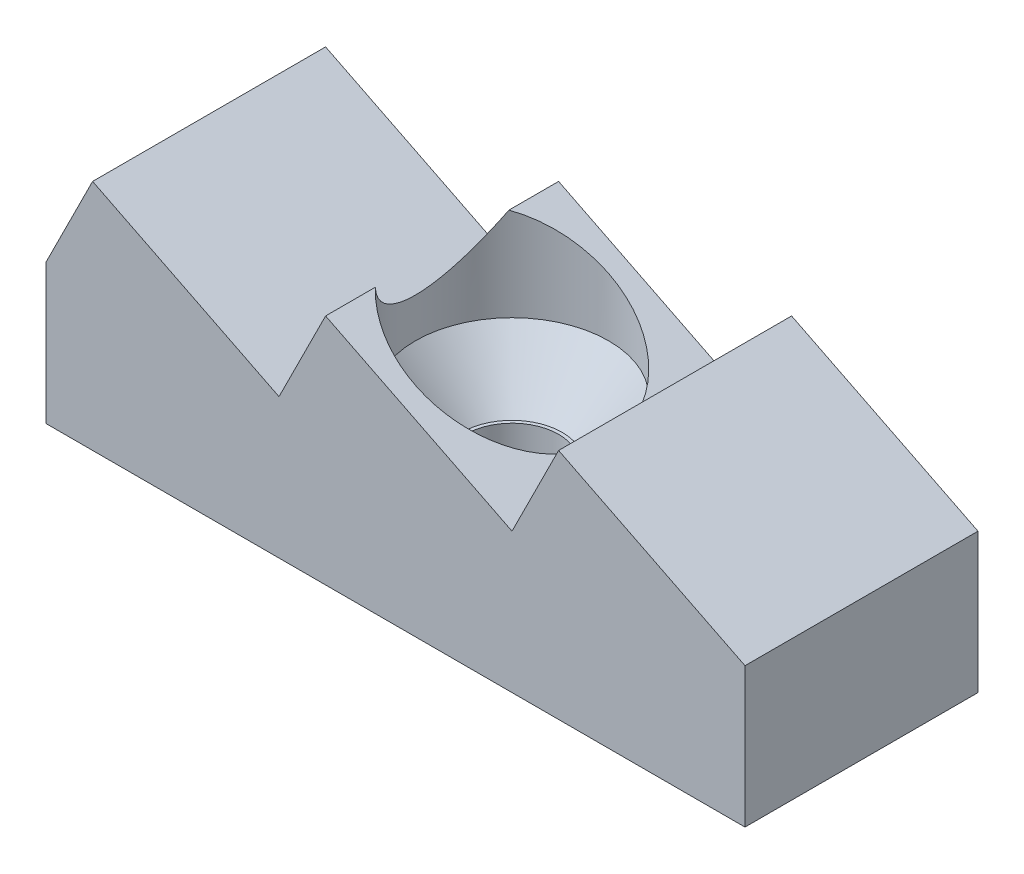
ISO-10303-21;
HEADER;
FILE_DESCRIPTION(('STEP AP214'),'2;1');
FILE_NAME('part.step','',(''),(''),'','','');
FILE_SCHEMA(('AUTOMOTIVE_DESIGN { 1 0 10303 214 1 1 1 1 }'));
ENDSEC;
DATA;
#1=APPLICATION_CONTEXT('core data for automotive mechanical design processes');
#2=APPLICATION_PROTOCOL_DEFINITION('international standard','automotive_design',2000,#1);
#3=PRODUCT_CONTEXT('',#1,'mechanical');
#4=PRODUCT('Part','Part','',(#3));
#5=PRODUCT_RELATED_PRODUCT_CATEGORY('part','',(#4));
#6=PRODUCT_DEFINITION_FORMATION('','',#4);
#7=PRODUCT_DEFINITION_CONTEXT('part definition',#1,'design');
#8=PRODUCT_DEFINITION('design','',#6,#7);
#9=PRODUCT_DEFINITION_SHAPE('','',#8);
#10=(LENGTH_UNIT() NAMED_UNIT(*) SI_UNIT(.MILLI.,.METRE.));
#11=(NAMED_UNIT(*) PLANE_ANGLE_UNIT() SI_UNIT($,.RADIAN.));
#12=(NAMED_UNIT(*) SI_UNIT($,.STERADIAN.) SOLID_ANGLE_UNIT());
#13=UNCERTAINTY_MEASURE_WITH_UNIT(LENGTH_MEASURE(1.E-05),#10,'distance_accuracy_value','');
#14=(GEOMETRIC_REPRESENTATION_CONTEXT(3) GLOBAL_UNCERTAINTY_ASSIGNED_CONTEXT((#13)) GLOBAL_UNIT_ASSIGNED_CONTEXT((#10,
#11,#12)) REPRESENTATION_CONTEXT('',''));
#15=CARTESIAN_POINT('',(0.,0.,0.));
#16=DIRECTION('',(0.,0.,1.));
#17=DIRECTION('',(1.,0.,0.));
#18=AXIS2_PLACEMENT_3D('',#15,#16,#17);
#19=CARTESIAN_POINT('',(0.,5.,0.));
#20=DIRECTION('',(0.,-1.,0.));
#21=DIRECTION('',(0.,0.,-1.));
#22=AXIS2_PLACEMENT_3D('',#19,#20,#21);
#23=CYLINDRICAL_SURFACE('',#22,1.);
#24=CARTESIAN_POINT('',(0.,1.8,0.));
#25=DIRECTION('',(0.,-1.,0.));
#26=DIRECTION('',(0.,0.,-1.));
#27=AXIS2_PLACEMENT_3D('',#24,#25,#26);
#28=CIRCLE('',#27,1.);
#29=CARTESIAN_POINT('',(0.,1.8,-1.));
#30=VERTEX_POINT('',#29);
#31=EDGE_CURVE('E157',#30,#30,#28,.T.);
#32=ORIENTED_EDGE('',*,*,#31,.F.);
#33=EDGE_LOOP('',(#32));
#34=FACE_BOUND('',#33,.T.);
#35=CARTESIAN_POINT('',(0.,1.,0.));
#36=DIRECTION('',(0.,-1.,0.));
#37=DIRECTION('',(0.,0.,-1.));
#38=AXIS2_PLACEMENT_3D('',#35,#36,#37);
#39=CIRCLE('',#38,1.);
#40=CARTESIAN_POINT('',(0.,1.,-1.));
#41=VERTEX_POINT('',#40);
#42=EDGE_CURVE('E81',#41,#41,#39,.T.);
#43=ORIENTED_EDGE('',*,*,#42,.T.);
#44=EDGE_LOOP('',(#43));
#45=FACE_BOUND('',#44,.T.);
#46=ADVANCED_FACE('F77',(#34,#45),#23,.F.);
#47=CARTESIAN_POINT('',(7.5,3.,0.));
#48=DIRECTION('',(1.,0.,0.));
#49=DIRECTION('',(0.,0.,-1.));
#50=AXIS2_PLACEMENT_3D('',#47,#48,#49);
#51=PLANE('',#50);
#52=DIRECTION('',(0.,0.,1.));
#53=VECTOR('',#52,1.);
#54=CARTESIAN_POINT('',(7.5,0.,0.));
#55=LINE('',#54,#53);
#56=CARTESIAN_POINT('',(7.5,0.,-2.5));
#57=VERTEX_POINT('',#56);
#58=CARTESIAN_POINT('',(7.5,0.,2.5));
#59=VERTEX_POINT('',#58);
#60=EDGE_CURVE('E124',#57,#59,#55,.T.);
#61=ORIENTED_EDGE('',*,*,#60,.F.);
#62=DIRECTION('',(0.,-1.,0.));
#63=VECTOR('',#62,1.);
#64=CARTESIAN_POINT('',(7.5,3.,-2.5));
#65=LINE('',#64,#63);
#66=CARTESIAN_POINT('',(7.5,3.,-2.5));
#67=VERTEX_POINT('',#66);
#68=EDGE_CURVE('E86',#67,#57,#65,.T.);
#69=ORIENTED_EDGE('',*,*,#68,.F.);
#70=DIRECTION('',(0.,0.,1.));
#71=VECTOR('',#70,1.);
#72=CARTESIAN_POINT('',(7.5,3.,0.));
#73=LINE('',#72,#71);
#74=CARTESIAN_POINT('',(7.5,3.,2.5));
#75=VERTEX_POINT('',#74);
#76=EDGE_CURVE('E128',#67,#75,#73,.T.);
#77=ORIENTED_EDGE('',*,*,#76,.T.);
#78=DIRECTION('',(0.,-1.,0.));
#79=VECTOR('',#78,1.);
#80=CARTESIAN_POINT('',(7.5,3.,2.5));
#81=LINE('',#80,#79);
#82=EDGE_CURVE('E120',#75,#59,#81,.T.);
#83=ORIENTED_EDGE('',*,*,#82,.T.);
#84=EDGE_LOOP('',(#61,#69,#77,#83));
#85=FACE_BOUND('',#84,.T.);
#86=ADVANCED_FACE('F79',(#85),#51,.T.);
#87=CARTESIAN_POINT('',(0.,3.,-2.5));
#88=DIRECTION('',(0.,0.,-1.));
#89=DIRECTION('',(-1.,0.,0.));
#90=AXIS2_PLACEMENT_3D('',#87,#88,#89);
#91=PLANE('',#90);
#92=DIRECTION('',(1.,0.,0.));
#93=VECTOR('',#92,1.);
#94=CARTESIAN_POINT('',(0.,0.,-2.5));
#95=LINE('',#94,#93);
#96=CARTESIAN_POINT('',(-7.5,0.,-2.5));
#97=VERTEX_POINT('',#96);
#98=EDGE_CURVE('E142',#97,#57,#95,.T.);
#99=ORIENTED_EDGE('',*,*,#98,.F.);
#100=DIRECTION('',(0.,-1.,0.));
#101=VECTOR('',#100,1.);
#102=CARTESIAN_POINT('',(-7.5,3.,-2.5));
#103=LINE('',#102,#101);
#104=CARTESIAN_POINT('',(-7.5,3.,-2.5));
#105=VERTEX_POINT('',#104);
#106=EDGE_CURVE('E154',#105,#97,#103,.T.);
#107=ORIENTED_EDGE('',*,*,#106,.F.);
#108=DIRECTION('',(-0.447213595499958,-0.894427190999916,0.));
#109=VECTOR('',#108,1.);
#110=CARTESIAN_POINT('',(-7.19999999999997,3.59999999999999,-2.5));
#111=LINE('',#110,#109);
#112=CARTESIAN_POINT('',(-6.5,4.99999999999993,-2.5));
#113=VERTEX_POINT('',#112);
#114=EDGE_CURVE('E222',#113,#105,#111,.T.);
#115=ORIENTED_EDGE('',*,*,#114,.F.);
#116=DIRECTION('',(-0.894427190999916,0.447213595499958,0.));
#117=VECTOR('',#116,1.);
#118=CARTESIAN_POINT('',(0.699999999999972,1.39999999999994,-2.5));
#119=LINE('',#118,#117);
#120=CARTESIAN_POINT('',(-2.5,2.99999999999996,-2.5));
#121=VERTEX_POINT('',#120);
#122=EDGE_CURVE('E215',#121,#113,#119,.T.);
#123=ORIENTED_EDGE('',*,*,#122,.F.);
#124=DIRECTION('',(-0.447213595499958,-0.894427190999916,0.));
#125=VECTOR('',#124,1.);
#126=CARTESIAN_POINT('',(-3.19999999999999,1.6,-2.5));
#127=LINE('',#126,#125);
#128=CARTESIAN_POINT('',(-1.5,4.99999999999997,-2.5));
#129=VERTEX_POINT('',#128);
#130=EDGE_CURVE('E207',#129,#121,#127,.T.);
#131=ORIENTED_EDGE('',*,*,#130,.F.);
#132=DIRECTION('',(-0.894427190999916,0.447213595499958,0.));
#133=VECTOR('',#132,1.);
#134=CARTESIAN_POINT('',(1.69999999999999,3.39999999999997,-2.5));
#135=LINE('',#134,#133);
#136=CARTESIAN_POINT('',(2.5,3.,-2.5));
#137=VERTEX_POINT('',#136);
#138=EDGE_CURVE('E196',#137,#129,#135,.T.);
#139=ORIENTED_EDGE('',*,*,#138,.F.);
#140=DIRECTION('',(-0.447213595499958,-0.894427190999916,0.));
#141=VECTOR('',#140,1.);
#142=CARTESIAN_POINT('',(0.799999999999995,-0.399999999999998,-2.5));
#143=LINE('',#142,#141);
#144=CARTESIAN_POINT('',(3.5,5.,-2.5));
#145=VERTEX_POINT('',#144);
#146=EDGE_CURVE('E176',#145,#137,#143,.T.);
#147=ORIENTED_EDGE('',*,*,#146,.F.);
#148=DIRECTION('',(-0.894427190999916,0.447213595499958,0.));
#149=VECTOR('',#148,1.);
#150=CARTESIAN_POINT('',(2.7,5.4,-2.5));
#151=LINE('',#150,#149);
#152=EDGE_CURVE('E188',#67,#145,#151,.T.);
#153=ORIENTED_EDGE('',*,*,#152,.F.);
#154=ORIENTED_EDGE('',*,*,#68,.T.);
#155=EDGE_LOOP('',(#99,#107,#115,#123,#131,#139,#147,#153,#154));
#156=FACE_BOUND('',#155,.T.);
#157=ADVANCED_FACE('F236',(#156),#91,.T.);
#158=CARTESIAN_POINT('',(-7.5,3.,0.));
#159=DIRECTION('',(1.,0.,0.));
#160=DIRECTION('',(0.,0.,-1.));
#161=AXIS2_PLACEMENT_3D('',#158,#159,#160);
#162=PLANE('',#161);
#163=DIRECTION('',(0.,0.,1.));
#164=VECTOR('',#163,1.);
#165=CARTESIAN_POINT('',(-7.5,0.,0.));
#166=LINE('',#165,#164);
#167=CARTESIAN_POINT('',(-7.5,0.,2.5));
#168=VERTEX_POINT('',#167);
#169=EDGE_CURVE('E138',#97,#168,#166,.T.);
#170=ORIENTED_EDGE('',*,*,#169,.T.);
#171=DIRECTION('',(0.,-1.,0.));
#172=VECTOR('',#171,1.);
#173=CARTESIAN_POINT('',(-7.5,3.,2.5));
#174=LINE('',#173,#172);
#175=CARTESIAN_POINT('',(-7.5,3.,2.5));
#176=VERTEX_POINT('',#175);
#177=EDGE_CURVE('E100',#176,#168,#174,.T.);
#178=ORIENTED_EDGE('',*,*,#177,.F.);
#179=DIRECTION('',(0.,0.,1.));
#180=VECTOR('',#179,1.);
#181=CARTESIAN_POINT('',(-7.5,3.,0.));
#182=LINE('',#181,#180);
#183=EDGE_CURVE('E131',#105,#176,#182,.T.);
#184=ORIENTED_EDGE('',*,*,#183,.F.);
#185=ORIENTED_EDGE('',*,*,#106,.T.);
#186=EDGE_LOOP('',(#170,#178,#184,#185));
#187=FACE_BOUND('',#186,.T.);
#188=ADVANCED_FACE('F234',(#187),#162,.F.);
#189=CARTESIAN_POINT('',(0.,3.,2.5));
#190=DIRECTION('',(0.,0.,-1.));
#191=DIRECTION('',(-1.,0.,0.));
#192=AXIS2_PLACEMENT_3D('',#189,#190,#191);
#193=PLANE('',#192);
#194=DIRECTION('',(1.,0.,0.));
#195=VECTOR('',#194,1.);
#196=CARTESIAN_POINT('',(0.,0.,2.5));
#197=LINE('',#196,#195);
#198=EDGE_CURVE('E134',#168,#59,#197,.T.);
#199=ORIENTED_EDGE('',*,*,#198,.T.);
#200=ORIENTED_EDGE('',*,*,#82,.F.);
#201=DIRECTION('',(-0.894427190999916,0.447213595499958,0.));
#202=VECTOR('',#201,1.);
#203=CARTESIAN_POINT('',(2.7,5.4,2.5));
#204=LINE('',#203,#202);
#205=CARTESIAN_POINT('',(3.5,5.,2.5));
#206=VERTEX_POINT('',#205);
#207=EDGE_CURVE('E194',#75,#206,#204,.T.);
#208=ORIENTED_EDGE('',*,*,#207,.T.);
#209=DIRECTION('',(-0.447213595499958,-0.894427190999916,0.));
#210=VECTOR('',#209,1.);
#211=CARTESIAN_POINT('',(0.799999999999995,-0.399999999999998,2.5));
#212=LINE('',#211,#210);
#213=CARTESIAN_POINT('',(2.5,3.,2.5));
#214=VERTEX_POINT('',#213);
#215=EDGE_CURVE('E191',#206,#214,#212,.T.);
#216=ORIENTED_EDGE('',*,*,#215,.T.);
#217=DIRECTION('',(-0.894427190999916,0.447213595499958,0.));
#218=VECTOR('',#217,1.);
#219=CARTESIAN_POINT('',(1.69999999999999,3.39999999999997,2.5));
#220=LINE('',#219,#218);
#221=CARTESIAN_POINT('',(-1.5,4.99999999999997,2.5));
#222=VERTEX_POINT('',#221);
#223=EDGE_CURVE('E202',#214,#222,#220,.T.);
#224=ORIENTED_EDGE('',*,*,#223,.T.);
#225=DIRECTION('',(-0.447213595499958,-0.894427190999916,0.));
#226=VECTOR('',#225,1.);
#227=CARTESIAN_POINT('',(-3.19999999999999,1.6,2.5));
#228=LINE('',#227,#226);
#229=CARTESIAN_POINT('',(-2.5,2.99999999999996,2.5));
#230=VERTEX_POINT('',#229);
#231=EDGE_CURVE('E212',#222,#230,#228,.T.);
#232=ORIENTED_EDGE('',*,*,#231,.T.);
#233=DIRECTION('',(-0.894427190999916,0.447213595499958,0.));
#234=VECTOR('',#233,1.);
#235=CARTESIAN_POINT('',(0.699999999999972,1.39999999999994,2.5));
#236=LINE('',#235,#234);
#237=CARTESIAN_POINT('',(-6.5,4.99999999999993,2.5));
#238=VERTEX_POINT('',#237);
#239=EDGE_CURVE('E218',#230,#238,#236,.T.);
#240=ORIENTED_EDGE('',*,*,#239,.T.);
#241=DIRECTION('',(-0.447213595499958,-0.894427190999916,0.));
#242=VECTOR('',#241,1.);
#243=CARTESIAN_POINT('',(-7.19999999999997,3.59999999999999,2.5));
#244=LINE('',#243,#242);
#245=EDGE_CURVE('E221',#238,#176,#244,.T.);
#246=ORIENTED_EDGE('',*,*,#245,.T.);
#247=ORIENTED_EDGE('',*,*,#177,.T.);
#248=EDGE_LOOP('',(#199,#200,#208,#216,#224,#232,#240,#246,#247));
#249=FACE_BOUND('',#248,.T.);
#250=ADVANCED_FACE('F135',(#249),#193,.F.);
#251=CARTESIAN_POINT('',(0.,0.,0.));
#252=DIRECTION('',(0.,1.,0.));
#253=DIRECTION('',(0.,0.,1.));
#254=AXIS2_PLACEMENT_3D('',#251,#252,#253);
#255=PLANE('',#254);
#256=CARTESIAN_POINT('',(0.,0.,0.));
#257=DIRECTION('',(0.,-1.,0.));
#258=DIRECTION('',(0.,0.,-1.));
#259=AXIS2_PLACEMENT_3D('',#256,#257,#258);
#260=CIRCLE('',#259,2.075);
#261=CARTESIAN_POINT('',(0.,0.,-2.075));
#262=VERTEX_POINT('',#261);
#263=EDGE_CURVE('E343',#262,#262,#260,.T.);
#264=ORIENTED_EDGE('',*,*,#263,.F.);
#265=EDGE_LOOP('',(#264));
#266=FACE_BOUND('',#265,.T.);
#267=CARTESIAN_POINT('',(-5.,0.,0.));
#268=DIRECTION('',(0.,1.,0.));
#269=DIRECTION('',(0.,0.,1.));
#270=AXIS2_PLACEMENT_3D('',#267,#268,#269);
#271=CIRCLE('',#270,2.1);
#272=CARTESIAN_POINT('',(-5.,0.,2.1));
#273=VERTEX_POINT('',#272);
#274=EDGE_CURVE('E177',#273,#273,#271,.T.);
#275=ORIENTED_EDGE('',*,*,#274,.T.);
#276=EDGE_LOOP('',(#275));
#277=FACE_BOUND('',#276,.T.);
#278=CARTESIAN_POINT('',(5.,0.,0.));
#279=DIRECTION('',(0.,1.,0.));
#280=DIRECTION('',(0.,0.,1.));
#281=AXIS2_PLACEMENT_3D('',#278,#279,#280);
#282=CIRCLE('',#281,2.1);
#283=CARTESIAN_POINT('',(5.,0.,2.1));
#284=VERTEX_POINT('',#283);
#285=EDGE_CURVE('E162',#284,#284,#282,.T.);
#286=ORIENTED_EDGE('',*,*,#285,.T.);
#287=EDGE_LOOP('',(#286));
#288=FACE_BOUND('',#287,.T.);
#289=ORIENTED_EDGE('',*,*,#60,.T.);
#290=ORIENTED_EDGE('',*,*,#198,.F.);
#291=ORIENTED_EDGE('',*,*,#169,.F.);
#292=ORIENTED_EDGE('',*,*,#98,.T.);
#293=EDGE_LOOP('',(#289,#290,#291,#292));
#294=FACE_BOUND('',#293,.T.);
#295=ADVANCED_FACE('F140',(#266,#277,#288,#294),#255,.F.);
#296=CARTESIAN_POINT('',(0.699999999999972,1.39999999999994,2.5));
#297=DIRECTION('',(-0.447213595499958,-0.894427190999916,0.));
#298=DIRECTION('',(0.894427190999916,-0.447213595499958,0.));
#299=AXIS2_PLACEMENT_3D('',#296,#297,#298);
#300=PLANE('',#299);
#301=ORIENTED_EDGE('',*,*,#122,.T.);
#302=DIRECTION('',(0.,0.,-1.));
#303=VECTOR('',#302,1.);
#304=CARTESIAN_POINT('',(-6.5,4.99999999999993,2.5));
#305=LINE('',#304,#303);
#306=EDGE_CURVE('E143',#238,#113,#305,.T.);
#307=ORIENTED_EDGE('',*,*,#306,.F.);
#308=ORIENTED_EDGE('',*,*,#239,.F.);
#309=DIRECTION('',(0.,0.,-1.));
#310=VECTOR('',#309,1.);
#311=CARTESIAN_POINT('',(-2.5,2.99999999999996,2.5));
#312=LINE('',#311,#310);
#313=EDGE_CURVE('E147',#230,#121,#312,.T.);
#314=ORIENTED_EDGE('',*,*,#313,.T.);
#315=EDGE_LOOP('',(#301,#307,#308,#314));
#316=FACE_BOUND('',#315,.T.);
#317=ADVANCED_FACE('F275',(#316),#300,.F.);
#318=CARTESIAN_POINT('',(-7.19999999999997,3.59999999999999,2.5));
#319=DIRECTION('',(0.894427190999916,-0.447213595499958,0.));
#320=DIRECTION('',(0.447213595499958,0.894427190999916,0.));
#321=AXIS2_PLACEMENT_3D('',#318,#319,#320);
#322=PLANE('',#321);
#323=ORIENTED_EDGE('',*,*,#114,.T.);
#324=ORIENTED_EDGE('',*,*,#183,.T.);
#325=ORIENTED_EDGE('',*,*,#245,.F.);
#326=ORIENTED_EDGE('',*,*,#306,.T.);
#327=EDGE_LOOP('',(#323,#324,#325,#326));
#328=FACE_BOUND('',#327,.T.);
#329=ADVANCED_FACE('F232',(#328),#322,.F.);
#330=CARTESIAN_POINT('',(1.69999999999999,3.39999999999997,2.5));
#331=DIRECTION('',(-0.447213595499958,-0.894427190999916,0.));
#332=DIRECTION('',(0.894427190999916,-0.447213595499958,0.));
#333=AXIS2_PLACEMENT_3D('',#330,#331,#332);
#334=PLANE('',#333);
#335=DIRECTION('',(0.,0.,-1.));
#336=VECTOR('',#335,1.);
#337=CARTESIAN_POINT('',(-1.5,4.99999999999997,2.5));
#338=LINE('',#337,#336);
#339=CARTESIAN_POINT('',(-1.5,4.99999999999997,-1.43374509589396));
#340=VERTEX_POINT('',#339);
#341=EDGE_CURVE('E203',#340,#129,#338,.T.);
#342=ORIENTED_EDGE('',*,*,#341,.F.);
#343=CARTESIAN_POINT('',(0.,4.24999999999996,0.));
#344=DIRECTION('',(-0.447213595499958,-0.894427190999916,0.));
#345=DIRECTION('',(0.894427190999916,-0.447213595499958,0.));
#346=AXIS2_PLACEMENT_3D('',#343,#344,#345);
#347=ELLIPSE('',#346,2.31992052665603,2.075);
#348=CARTESIAN_POINT('',(-1.5,4.99999999999997,1.43374509589396));
#349=VERTEX_POINT('',#348);
#350=EDGE_CURVE('E92',#340,#349,#347,.T.);
#351=ORIENTED_EDGE('',*,*,#350,.T.);
#352=EDGE_CURVE('E199',#222,#349,#338,.T.);
#353=ORIENTED_EDGE('',*,*,#352,.F.);
#354=ORIENTED_EDGE('',*,*,#223,.F.);
#355=DIRECTION('',(0.,0.,-1.));
#356=VECTOR('',#355,1.);
#357=CARTESIAN_POINT('',(2.5,3.,2.5));
#358=LINE('',#357,#356);
#359=EDGE_CURVE('E204',#214,#137,#358,.T.);
#360=ORIENTED_EDGE('',*,*,#359,.T.);
#361=ORIENTED_EDGE('',*,*,#138,.T.);
#362=EDGE_LOOP('',(#342,#351,#353,#354,#360,#361));
#363=FACE_BOUND('',#362,.T.);
#364=ADVANCED_FACE('F280',(#363),#334,.F.);
#365=CARTESIAN_POINT('',(-3.19999999999999,1.6,2.5));
#366=DIRECTION('',(0.894427190999916,-0.447213595499958,0.));
#367=DIRECTION('',(0.447213595499958,0.894427190999916,0.));
#368=AXIS2_PLACEMENT_3D('',#365,#366,#367);
#369=PLANE('',#368);
#370=ORIENTED_EDGE('',*,*,#352,.T.);
#371=CARTESIAN_POINT('',(0.,7.99999999999997,0.));
#372=DIRECTION('',(0.894427190999916,-0.447213595499958,0.));
#373=DIRECTION('',(-0.447213595499958,-0.894427190999916,0.));
#374=AXIS2_PLACEMENT_3D('',#371,#372,#373);
#375=ELLIPSE('',#374,4.63984105331206,2.075);
#376=EDGE_CURVE('E12',#349,#340,#375,.T.);
#377=ORIENTED_EDGE('',*,*,#376,.T.);
#378=ORIENTED_EDGE('',*,*,#341,.T.);
#379=ORIENTED_EDGE('',*,*,#130,.T.);
#380=ORIENTED_EDGE('',*,*,#313,.F.);
#381=ORIENTED_EDGE('',*,*,#231,.F.);
#382=EDGE_LOOP('',(#370,#377,#378,#379,#380,#381));
#383=FACE_BOUND('',#382,.T.);
#384=ADVANCED_FACE('F269',(#383),#369,.F.);
#385=CARTESIAN_POINT('',(0.799999999999995,-0.399999999999998,2.5));
#386=DIRECTION('',(0.894427190999916,-0.447213595499958,0.));
#387=DIRECTION('',(0.447213595499958,0.894427190999916,0.));
#388=AXIS2_PLACEMENT_3D('',#385,#386,#387);
#389=PLANE('',#388);
#390=ORIENTED_EDGE('',*,*,#146,.T.);
#391=ORIENTED_EDGE('',*,*,#359,.F.);
#392=ORIENTED_EDGE('',*,*,#215,.F.);
#393=DIRECTION('',(0.,0.,-1.));
#394=VECTOR('',#393,1.);
#395=CARTESIAN_POINT('',(3.5,5.,2.5));
#396=LINE('',#395,#394);
#397=EDGE_CURVE('E185',#206,#145,#396,.T.);
#398=ORIENTED_EDGE('',*,*,#397,.T.);
#399=EDGE_LOOP('',(#390,#391,#392,#398));
#400=FACE_BOUND('',#399,.T.);
#401=ADVANCED_FACE('F283',(#400),#389,.F.);
#402=CARTESIAN_POINT('',(2.7,5.4,2.5));
#403=DIRECTION('',(-0.447213595499958,-0.894427190999916,0.));
#404=DIRECTION('',(0.894427190999916,-0.447213595499958,0.));
#405=AXIS2_PLACEMENT_3D('',#402,#403,#404);
#406=PLANE('',#405);
#407=ORIENTED_EDGE('',*,*,#152,.T.);
#408=ORIENTED_EDGE('',*,*,#397,.F.);
#409=ORIENTED_EDGE('',*,*,#207,.F.);
#410=ORIENTED_EDGE('',*,*,#76,.F.);
#411=EDGE_LOOP('',(#407,#408,#409,#410));
#412=FACE_BOUND('',#411,.T.);
#413=ADVANCED_FACE('F286',(#412),#406,.F.);
#414=CARTESIAN_POINT('',(5.,1.4,0.));
#415=DIRECTION('',(0.,-1.,0.));
#416=DIRECTION('',(0.,0.,-1.));
#417=AXIS2_PLACEMENT_3D('',#414,#415,#416);
#418=CYLINDRICAL_SURFACE('',#417,2.1);
#419=CARTESIAN_POINT('',(5.,1.4,0.));
#420=DIRECTION('',(0.,1.,0.));
#421=DIRECTION('',(0.,0.,1.));
#422=AXIS2_PLACEMENT_3D('',#419,#420,#421);
#423=CIRCLE('',#422,2.1);
#424=CARTESIAN_POINT('',(5.,1.4,2.1));
#425=VERTEX_POINT('',#424);
#426=EDGE_CURVE('E180',#425,#425,#423,.T.);
#427=ORIENTED_EDGE('',*,*,#426,.T.);
#428=EDGE_LOOP('',(#427));
#429=FACE_BOUND('',#428,.T.);
#430=ORIENTED_EDGE('',*,*,#285,.F.);
#431=EDGE_LOOP('',(#430));
#432=FACE_BOUND('',#431,.T.);
#433=ADVANCED_FACE('F288',(#429,#432),#418,.F.);
#434=CARTESIAN_POINT('',(0.,1.4,0.));
#435=DIRECTION('',(0.,1.,0.));
#436=DIRECTION('',(0.,0.,1.));
#437=AXIS2_PLACEMENT_3D('',#434,#435,#436);
#438=PLANE('',#437);
#439=ORIENTED_EDGE('',*,*,#426,.F.);
#440=EDGE_LOOP('',(#439));
#441=FACE_BOUND('',#440,.T.);
#442=ADVANCED_FACE('F294',(#441),#438,.F.);
#443=CARTESIAN_POINT('',(-5.,1.4,0.));
#444=DIRECTION('',(0.,-1.,0.));
#445=DIRECTION('',(0.,0.,-1.));
#446=AXIS2_PLACEMENT_3D('',#443,#444,#445);
#447=CYLINDRICAL_SURFACE('',#446,2.1);
#448=CARTESIAN_POINT('',(-5.,1.4,0.));
#449=DIRECTION('',(0.,1.,0.));
#450=DIRECTION('',(0.,0.,1.));
#451=AXIS2_PLACEMENT_3D('',#448,#449,#450);
#452=CIRCLE('',#451,2.1);
#453=CARTESIAN_POINT('',(-5.,1.4,2.1));
#454=VERTEX_POINT('',#453);
#455=EDGE_CURVE('E173',#454,#454,#452,.T.);
#456=ORIENTED_EDGE('',*,*,#455,.T.);
#457=EDGE_LOOP('',(#456));
#458=FACE_BOUND('',#457,.T.);
#459=ORIENTED_EDGE('',*,*,#274,.F.);
#460=EDGE_LOOP('',(#459));
#461=FACE_BOUND('',#460,.T.);
#462=ADVANCED_FACE('F309',(#458,#461),#447,.F.);
#463=CARTESIAN_POINT('',(0.,1.4,0.));
#464=DIRECTION('',(0.,1.,0.));
#465=DIRECTION('',(0.,0.,1.));
#466=AXIS2_PLACEMENT_3D('',#463,#464,#465);
#467=PLANE('',#466);
#468=ORIENTED_EDGE('',*,*,#455,.F.);
#469=EDGE_LOOP('',(#468));
#470=FACE_BOUND('',#469,.T.);
#471=ADVANCED_FACE('F313',(#470),#467,.F.);
#472=CARTESIAN_POINT('',(0.,0.,0.));
#473=DIRECTION('',(0.,-1.,0.));
#474=DIRECTION('',(0.,0.,-1.));
#475=AXIS2_PLACEMENT_3D('',#472,#473,#474);
#476=CYLINDRICAL_SURFACE('',#475,2.075);
#477=CARTESIAN_POINT('',(0.,3.,0.));
#478=DIRECTION('',(0.,-1.,0.));
#479=DIRECTION('',(0.,0.,-1.));
#480=AXIS2_PLACEMENT_3D('',#477,#478,#479);
#481=CIRCLE('',#480,2.075);
#482=CARTESIAN_POINT('',(0.,3.,-2.075));
#483=VERTEX_POINT('',#482);
#484=EDGE_CURVE('E159',#483,#483,#481,.T.);
#485=ORIENTED_EDGE('',*,*,#484,.T.);
#486=EDGE_LOOP('',(#485));
#487=FACE_BOUND('',#486,.T.);
#488=ORIENTED_EDGE('',*,*,#376,.F.);
#489=ORIENTED_EDGE('',*,*,#350,.F.);
#490=EDGE_LOOP('',(#488,#489));
#491=FACE_BOUND('',#490,.T.);
#492=ADVANCED_FACE('F317',(#487,#491),#476,.F.);
#493=CARTESIAN_POINT('',(0.,1.8,0.));
#494=DIRECTION('',(0.,1.,0.));
#495=DIRECTION('',(0.,0.,1.));
#496=AXIS2_PLACEMENT_3D('',#493,#494,#495);
#497=CONICAL_SURFACE('',#496,1.075,0.694738276196703);
#498=ORIENTED_EDGE('',*,*,#484,.F.);
#499=EDGE_LOOP('',(#498));
#500=FACE_BOUND('',#499,.T.);
#501=CARTESIAN_POINT('',(0.,1.8,0.));
#502=DIRECTION('',(0.,-1.,0.));
#503=DIRECTION('',(0.,0.,-1.));
#504=AXIS2_PLACEMENT_3D('',#501,#502,#503);
#505=CIRCLE('',#504,1.075);
#506=CARTESIAN_POINT('',(0.,1.8,-1.075));
#507=VERTEX_POINT('',#506);
#508=EDGE_CURVE('E165',#507,#507,#505,.T.);
#509=ORIENTED_EDGE('',*,*,#508,.T.);
#510=EDGE_LOOP('',(#509));
#511=FACE_BOUND('',#510,.T.);
#512=ADVANCED_FACE('F319',(#500,#511),#497,.F.);
#513=CARTESIAN_POINT('',(0.,1.8,0.));
#514=DIRECTION('',(0.,-1.,0.));
#515=DIRECTION('',(0.,0.,-1.));
#516=AXIS2_PLACEMENT_3D('',#513,#514,#515);
#517=PLANE('',#516);
#518=ORIENTED_EDGE('',*,*,#31,.T.);
#519=EDGE_LOOP('',(#518));
#520=FACE_BOUND('',#519,.T.);
#521=ORIENTED_EDGE('',*,*,#508,.F.);
#522=EDGE_LOOP('',(#521));
#523=FACE_BOUND('',#522,.T.);
#524=ADVANCED_FACE('F322',(#520,#523),#517,.F.);
#525=CARTESIAN_POINT('',(0.,1.,0.));
#526=DIRECTION('',(0.,-1.,0.));
#527=DIRECTION('',(0.,0.,-1.));
#528=AXIS2_PLACEMENT_3D('',#525,#526,#527);
#529=CYLINDRICAL_SURFACE('',#528,2.075);
#530=CARTESIAN_POINT('',(0.,1.,0.));
#531=DIRECTION('',(0.,-1.,0.));
#532=DIRECTION('',(0.,0.,-1.));
#533=AXIS2_PLACEMENT_3D('',#530,#531,#532);
#534=CIRCLE('',#533,2.075);
#535=CARTESIAN_POINT('',(0.,1.,-2.075));
#536=VERTEX_POINT('',#535);
#537=EDGE_CURVE('E342',#536,#536,#534,.T.);
#538=ORIENTED_EDGE('',*,*,#537,.F.);
#539=EDGE_LOOP('',(#538));
#540=FACE_BOUND('',#539,.T.);
#541=ORIENTED_EDGE('',*,*,#263,.T.);
#542=EDGE_LOOP('',(#541));
#543=FACE_BOUND('',#542,.T.);
#544=ADVANCED_FACE('F328',(#540,#543),#529,.F.);
#545=CARTESIAN_POINT('',(0.,1.,0.));
#546=DIRECTION('',(0.,-1.,0.));
#547=DIRECTION('',(0.,0.,-1.));
#548=AXIS2_PLACEMENT_3D('',#545,#546,#547);
#549=PLANE('',#548);
#550=ORIENTED_EDGE('',*,*,#42,.F.);
#551=EDGE_LOOP('',(#550));
#552=FACE_BOUND('',#551,.T.);
#553=ORIENTED_EDGE('',*,*,#537,.T.);
#554=EDGE_LOOP('',(#553));
#555=FACE_BOUND('',#554,.T.);
#556=ADVANCED_FACE('F331',(#552,#555),#549,.T.);
#557=CLOSED_SHELL('',(#46,#86,#157,#188,#250,#295,#317,#329,#364,#384,#401,#413,#433,#442,#462,
#471,#492,#512,#524,#544,#556));
#558=MANIFOLD_SOLID_BREP('B2',#557);
#559=ADVANCED_BREP_SHAPE_REPRESENTATION('',(#18,#558),#14);
#560=SHAPE_DEFINITION_REPRESENTATION(#9,#559);
ENDSEC;
END-ISO-10303-21;
